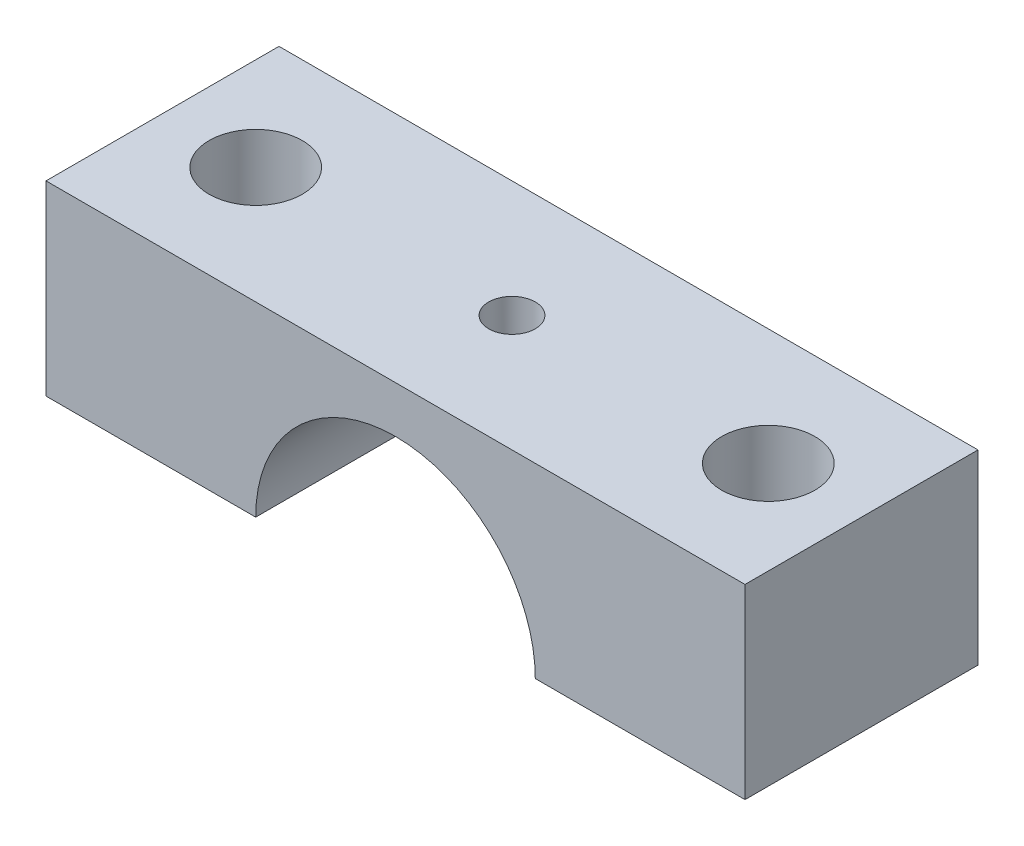
ISO-10303-21;
HEADER;
FILE_DESCRIPTION(('STEP AP214'),'2;1');
FILE_NAME('part.step','',(''),(''),'','','');
FILE_SCHEMA(('AUTOMOTIVE_DESIGN { 1 0 10303 214 1 1 1 1 }'));
ENDSEC;
DATA;
#1=APPLICATION_CONTEXT('core data for automotive mechanical design processes');
#2=APPLICATION_PROTOCOL_DEFINITION('international standard','automotive_design',2000,#1);
#3=PRODUCT_CONTEXT('',#1,'mechanical');
#4=PRODUCT('Part','Part','',(#3));
#5=PRODUCT_RELATED_PRODUCT_CATEGORY('part','',(#4));
#6=PRODUCT_DEFINITION_FORMATION('','',#4);
#7=PRODUCT_DEFINITION_CONTEXT('part definition',#1,'design');
#8=PRODUCT_DEFINITION('design','',#6,#7);
#9=PRODUCT_DEFINITION_SHAPE('','',#8);
#10=(LENGTH_UNIT() NAMED_UNIT(*) SI_UNIT(.MILLI.,.METRE.));
#11=(NAMED_UNIT(*) PLANE_ANGLE_UNIT() SI_UNIT($,.RADIAN.));
#12=(NAMED_UNIT(*) SI_UNIT($,.STERADIAN.) SOLID_ANGLE_UNIT());
#13=UNCERTAINTY_MEASURE_WITH_UNIT(LENGTH_MEASURE(1.E-05),#10,'distance_accuracy_value','');
#14=(GEOMETRIC_REPRESENTATION_CONTEXT(3) GLOBAL_UNCERTAINTY_ASSIGNED_CONTEXT((#13)) GLOBAL_UNIT_ASSIGNED_CONTEXT((#10,
#11,#12)) REPRESENTATION_CONTEXT('',''));
#15=CARTESIAN_POINT('',(0.,0.,0.));
#16=DIRECTION('',(0.,0.,1.));
#17=DIRECTION('',(1.,0.,0.));
#18=AXIS2_PLACEMENT_3D('',#15,#16,#17);
#19=CARTESIAN_POINT('',(0.,0.,0.));
#20=DIRECTION('',(0.,1.,0.));
#21=DIRECTION('',(0.,0.,1.));
#22=AXIS2_PLACEMENT_3D('',#19,#20,#21);
#23=PLANE('',#22);
#24=CARTESIAN_POINT('',(-11.,0.,0.));
#25=DIRECTION('',(0.,1.,0.));
#26=DIRECTION('',(0.,0.,1.));
#27=AXIS2_PLACEMENT_3D('',#24,#25,#26);
#28=CIRCLE('',#27,2.);
#29=CARTESIAN_POINT('',(-11.,0.,2.));
#30=VERTEX_POINT('',#29);
#31=EDGE_CURVE('E169',#30,#30,#28,.T.);
#32=ORIENTED_EDGE('',*,*,#31,.T.);
#33=EDGE_LOOP('',(#32));
#34=FACE_BOUND('',#33,.T.);
#35=DIRECTION('',(-1.,0.,0.));
#36=VECTOR('',#35,1.);
#37=CARTESIAN_POINT('',(-15.,0.,-5.));
#38=LINE('',#37,#36);
#39=CARTESIAN_POINT('',(-6.,0.,-5.));
#40=VERTEX_POINT('',#39);
#41=CARTESIAN_POINT('',(-15.,0.,-5.));
#42=VERTEX_POINT('',#41);
#43=EDGE_CURVE('E128',#40,#42,#38,.T.);
#44=ORIENTED_EDGE('',*,*,#43,.F.);
#45=DIRECTION('',(0.,0.,1.));
#46=VECTOR('',#45,1.);
#47=CARTESIAN_POINT('',(-6.,0.,-5.));
#48=LINE('',#47,#46);
#49=CARTESIAN_POINT('',(-6.,0.,5.));
#50=VERTEX_POINT('',#49);
#51=EDGE_CURVE('E110',#40,#50,#48,.T.);
#52=ORIENTED_EDGE('',*,*,#51,.T.);
#53=DIRECTION('',(1.,0.,0.));
#54=VECTOR('',#53,1.);
#55=CARTESIAN_POINT('',(-15.,0.,5.));
#56=LINE('',#55,#54);
#57=CARTESIAN_POINT('',(-15.,0.,5.));
#58=VERTEX_POINT('',#57);
#59=EDGE_CURVE('E137',#58,#50,#56,.T.);
#60=ORIENTED_EDGE('',*,*,#59,.F.);
#61=DIRECTION('',(0.,0.,1.));
#62=VECTOR('',#61,1.);
#63=CARTESIAN_POINT('',(-15.,0.,-5.));
#64=LINE('',#63,#62);
#65=EDGE_CURVE('E127',#42,#58,#64,.T.);
#66=ORIENTED_EDGE('',*,*,#65,.F.);
#67=EDGE_LOOP('',(#44,#52,#60,#66));
#68=FACE_BOUND('',#67,.T.);
#69=ADVANCED_FACE('F41',(#34,#68),#23,.F.);
#70=CARTESIAN_POINT('',(0.,8.,0.));
#71=DIRECTION('',(0.,1.,0.));
#72=DIRECTION('',(0.,0.,1.));
#73=AXIS2_PLACEMENT_3D('',#70,#71,#72);
#74=PLANE('',#73);
#75=CARTESIAN_POINT('',(11.,8.,0.));
#76=DIRECTION('',(0.,1.,0.));
#77=DIRECTION('',(0.,0.,1.));
#78=AXIS2_PLACEMENT_3D('',#75,#76,#77);
#79=CIRCLE('',#78,2.);
#80=CARTESIAN_POINT('',(11.,8.,1.99999999999999));
#81=VERTEX_POINT('',#80);
#82=EDGE_CURVE('E174',#81,#81,#79,.T.);
#83=ORIENTED_EDGE('',*,*,#82,.F.);
#84=EDGE_LOOP('',(#83));
#85=FACE_BOUND('',#84,.T.);
#86=DIRECTION('',(0.,0.,-1.));
#87=VECTOR('',#86,1.);
#88=CARTESIAN_POINT('',(15.,8.,-5.));
#89=LINE('',#88,#87);
#90=CARTESIAN_POINT('',(15.,8.,5.));
#91=VERTEX_POINT('',#90);
#92=CARTESIAN_POINT('',(15.,8.,-5.));
#93=VERTEX_POINT('',#92);
#94=EDGE_CURVE('E141',#91,#93,#89,.T.);
#95=ORIENTED_EDGE('',*,*,#94,.T.);
#96=DIRECTION('',(-1.,0.,0.));
#97=VECTOR('',#96,1.);
#98=CARTESIAN_POINT('',(-15.,8.,-5.));
#99=LINE('',#98,#97);
#100=CARTESIAN_POINT('',(-15.,8.,-5.));
#101=VERTEX_POINT('',#100);
#102=EDGE_CURVE('E99',#93,#101,#99,.T.);
#103=ORIENTED_EDGE('',*,*,#102,.T.);
#104=DIRECTION('',(0.,0.,1.));
#105=VECTOR('',#104,1.);
#106=CARTESIAN_POINT('',(-15.,8.,-5.));
#107=LINE('',#106,#105);
#108=CARTESIAN_POINT('',(-15.,8.,5.));
#109=VERTEX_POINT('',#108);
#110=EDGE_CURVE('E156',#101,#109,#107,.T.);
#111=ORIENTED_EDGE('',*,*,#110,.T.);
#112=DIRECTION('',(1.,0.,0.));
#113=VECTOR('',#112,1.);
#114=CARTESIAN_POINT('',(-15.,8.,5.));
#115=LINE('',#114,#113);
#116=EDGE_CURVE('E72',#109,#91,#115,.T.);
#117=ORIENTED_EDGE('',*,*,#116,.T.);
#118=EDGE_LOOP('',(#95,#103,#111,#117));
#119=FACE_BOUND('',#118,.T.);
#120=CARTESIAN_POINT('',(-11.,8.,0.));
#121=DIRECTION('',(0.,1.,0.));
#122=DIRECTION('',(0.,0.,1.));
#123=AXIS2_PLACEMENT_3D('',#120,#121,#122);
#124=CIRCLE('',#123,2.);
#125=CARTESIAN_POINT('',(-11.,8.,2.));
#126=VERTEX_POINT('',#125);
#127=EDGE_CURVE('E173',#126,#126,#124,.T.);
#128=ORIENTED_EDGE('',*,*,#127,.F.);
#129=EDGE_LOOP('',(#128));
#130=FACE_BOUND('',#129,.T.);
#131=CARTESIAN_POINT('',(0.,8.,0.));
#132=DIRECTION('',(0.,1.,0.));
#133=DIRECTION('',(0.,0.,1.));
#134=AXIS2_PLACEMENT_3D('',#131,#132,#133);
#135=CIRCLE('',#134,1.);
#136=CARTESIAN_POINT('',(0.,8.,0.999999999999997));
#137=VERTEX_POINT('',#136);
#138=EDGE_CURVE('E182',#137,#137,#135,.T.);
#139=ORIENTED_EDGE('',*,*,#138,.F.);
#140=EDGE_LOOP('',(#139));
#141=FACE_BOUND('',#140,.T.);
#142=ADVANCED_FACE('F196',(#85,#119,#130,#141),#74,.T.);
#143=CARTESIAN_POINT('',(6.,0.,5.));
#144=VERTEX_POINT('',#143);
#145=CARTESIAN_POINT('',(15.,0.,5.));
#146=VERTEX_POINT('',#145);
#147=EDGE_CURVE('E92',#144,#146,#56,.T.);
#148=ORIENTED_EDGE('',*,*,#147,.F.);
#149=DIRECTION('',(0.,0.,1.));
#150=VECTOR('',#149,1.);
#151=CARTESIAN_POINT('',(6.,0.,-5.));
#152=LINE('',#151,#150);
#153=CARTESIAN_POINT('',(6.,0.,-5.));
#154=VERTEX_POINT('',#153);
#155=EDGE_CURVE('E63',#144,#154,#152,.F.);
#156=ORIENTED_EDGE('',*,*,#155,.T.);
#157=CARTESIAN_POINT('',(15.,0.,-5.));
#158=VERTEX_POINT('',#157);
#159=EDGE_CURVE('E120',#158,#154,#38,.T.);
#160=ORIENTED_EDGE('',*,*,#159,.F.);
#161=DIRECTION('',(0.,0.,-1.));
#162=VECTOR('',#161,1.);
#163=CARTESIAN_POINT('',(15.,0.,-5.));
#164=LINE('',#163,#162);
#165=EDGE_CURVE('E133',#146,#158,#164,.T.);
#166=ORIENTED_EDGE('',*,*,#165,.F.);
#167=EDGE_LOOP('',(#148,#156,#160,#166));
#168=FACE_BOUND('',#167,.T.);
#169=CARTESIAN_POINT('',(11.,0.,0.));
#170=DIRECTION('',(0.,1.,0.));
#171=DIRECTION('',(0.,0.,1.));
#172=AXIS2_PLACEMENT_3D('',#169,#170,#171);
#173=CIRCLE('',#172,2.);
#174=CARTESIAN_POINT('',(11.,0.,1.99999999999999));
#175=VERTEX_POINT('',#174);
#176=EDGE_CURVE('E178',#175,#175,#173,.T.);
#177=ORIENTED_EDGE('',*,*,#176,.T.);
#178=EDGE_LOOP('',(#177));
#179=FACE_BOUND('',#178,.T.);
#180=ADVANCED_FACE('F117',(#168,#179),#23,.F.);
#181=CARTESIAN_POINT('',(15.,8.,-5.));
#182=DIRECTION('',(-1.,0.,0.));
#183=DIRECTION('',(0.,0.,1.));
#184=AXIS2_PLACEMENT_3D('',#181,#182,#183);
#185=PLANE('',#184);
#186=ORIENTED_EDGE('',*,*,#165,.T.);
#187=DIRECTION('',(0.,-1.,0.));
#188=VECTOR('',#187,1.);
#189=CARTESIAN_POINT('',(15.,8.,-5.));
#190=LINE('',#189,#188);
#191=EDGE_CURVE('E11',#93,#158,#190,.T.);
#192=ORIENTED_EDGE('',*,*,#191,.F.);
#193=ORIENTED_EDGE('',*,*,#94,.F.);
#194=DIRECTION('',(0.,-1.,0.));
#195=VECTOR('',#194,1.);
#196=CARTESIAN_POINT('',(15.,8.,5.));
#197=LINE('',#196,#195);
#198=EDGE_CURVE('E142',#91,#146,#197,.T.);
#199=ORIENTED_EDGE('',*,*,#198,.T.);
#200=EDGE_LOOP('',(#186,#192,#193,#199));
#201=FACE_BOUND('',#200,.T.);
#202=ADVANCED_FACE('F43',(#201),#185,.F.);
#203=CARTESIAN_POINT('',(-15.,8.,-5.));
#204=DIRECTION('',(0.,0.,1.));
#205=DIRECTION('',(1.,0.,0.));
#206=AXIS2_PLACEMENT_3D('',#203,#204,#205);
#207=PLANE('',#206);
#208=ORIENTED_EDGE('',*,*,#159,.T.);
#209=CARTESIAN_POINT('',(0.,0.,-5.));
#210=DIRECTION('',(0.,0.,1.));
#211=DIRECTION('',(1.,0.,0.));
#212=AXIS2_PLACEMENT_3D('',#209,#210,#211);
#213=CIRCLE('',#212,6.);
#214=EDGE_CURVE('E107',#154,#40,#213,.T.);
#215=ORIENTED_EDGE('',*,*,#214,.T.);
#216=ORIENTED_EDGE('',*,*,#43,.T.);
#217=DIRECTION('',(0.,-1.,0.));
#218=VECTOR('',#217,1.);
#219=CARTESIAN_POINT('',(-15.,8.,-5.));
#220=LINE('',#219,#218);
#221=EDGE_CURVE('E56',#101,#42,#220,.T.);
#222=ORIENTED_EDGE('',*,*,#221,.F.);
#223=ORIENTED_EDGE('',*,*,#102,.F.);
#224=ORIENTED_EDGE('',*,*,#191,.T.);
#225=EDGE_LOOP('',(#208,#215,#216,#222,#223,#224));
#226=FACE_BOUND('',#225,.T.);
#227=ADVANCED_FACE('F123',(#226),#207,.F.);
#228=CARTESIAN_POINT('',(-15.,8.,-5.));
#229=DIRECTION('',(1.,0.,0.));
#230=DIRECTION('',(0.,0.,-1.));
#231=AXIS2_PLACEMENT_3D('',#228,#229,#230);
#232=PLANE('',#231);
#233=ORIENTED_EDGE('',*,*,#65,.T.);
#234=DIRECTION('',(0.,-1.,0.));
#235=VECTOR('',#234,1.);
#236=CARTESIAN_POINT('',(-15.,8.,5.));
#237=LINE('',#236,#235);
#238=EDGE_CURVE('E145',#109,#58,#237,.T.);
#239=ORIENTED_EDGE('',*,*,#238,.F.);
#240=ORIENTED_EDGE('',*,*,#110,.F.);
#241=ORIENTED_EDGE('',*,*,#221,.T.);
#242=EDGE_LOOP('',(#233,#239,#240,#241));
#243=FACE_BOUND('',#242,.T.);
#244=ADVANCED_FACE('F154',(#243),#232,.F.);
#245=CARTESIAN_POINT('',(-15.,8.,5.));
#246=DIRECTION('',(0.,0.,-1.));
#247=DIRECTION('',(-1.,0.,0.));
#248=AXIS2_PLACEMENT_3D('',#245,#246,#247);
#249=PLANE('',#248);
#250=ORIENTED_EDGE('',*,*,#59,.T.);
#251=CARTESIAN_POINT('',(0.,0.,5.));
#252=DIRECTION('',(0.,0.,1.));
#253=DIRECTION('',(1.,0.,0.));
#254=AXIS2_PLACEMENT_3D('',#251,#252,#253);
#255=CIRCLE('',#254,6.);
#256=EDGE_CURVE('E114',#144,#50,#255,.T.);
#257=ORIENTED_EDGE('',*,*,#256,.F.);
#258=ORIENTED_EDGE('',*,*,#147,.T.);
#259=ORIENTED_EDGE('',*,*,#198,.F.);
#260=ORIENTED_EDGE('',*,*,#116,.F.);
#261=ORIENTED_EDGE('',*,*,#238,.T.);
#262=EDGE_LOOP('',(#250,#257,#258,#259,#260,#261));
#263=FACE_BOUND('',#262,.T.);
#264=ADVANCED_FACE('F159',(#263),#249,.F.);
#265=CARTESIAN_POINT('',(-11.,8.,0.));
#266=DIRECTION('',(0.,-1.,0.));
#267=DIRECTION('',(0.,0.,-1.));
#268=AXIS2_PLACEMENT_3D('',#265,#266,#267);
#269=CYLINDRICAL_SURFACE('',#268,2.);
#270=ORIENTED_EDGE('',*,*,#127,.T.);
#271=EDGE_LOOP('',(#270));
#272=FACE_BOUND('',#271,.T.);
#273=ORIENTED_EDGE('',*,*,#31,.F.);
#274=EDGE_LOOP('',(#273));
#275=FACE_BOUND('',#274,.T.);
#276=ADVANCED_FACE('F214',(#272,#275),#269,.F.);
#277=CARTESIAN_POINT('',(11.,8.,0.));
#278=DIRECTION('',(0.,-1.,0.));
#279=DIRECTION('',(0.,0.,-1.));
#280=AXIS2_PLACEMENT_3D('',#277,#278,#279);
#281=CYLINDRICAL_SURFACE('',#280,2.);
#282=ORIENTED_EDGE('',*,*,#82,.T.);
#283=EDGE_LOOP('',(#282));
#284=FACE_BOUND('',#283,.T.);
#285=ORIENTED_EDGE('',*,*,#176,.F.);
#286=EDGE_LOOP('',(#285));
#287=FACE_BOUND('',#286,.T.);
#288=ADVANCED_FACE('F207',(#284,#287),#281,.F.);
#289=CARTESIAN_POINT('',(0.,8.,0.));
#290=DIRECTION('',(0.,-1.,0.));
#291=DIRECTION('',(0.,0.,-1.));
#292=AXIS2_PLACEMENT_3D('',#289,#290,#291);
#293=CYLINDRICAL_SURFACE('',#292,1.);
#294=CARTESIAN_POINT('',(0.,6.,-1.));
#295=CARTESIAN_POINT('',(-0.0557563619832807,5.9999990446753,-0.999997764420877));
#296=CARTESIAN_POINT('',(-0.111543152735523,5.99921471165214,-0.995321090012435));
#297=CARTESIAN_POINT('',(-0.221552088669212,5.99616137976555,-0.976745736493873));
#298=CARTESIAN_POINT('',(-0.275772747183694,5.99389101569556,-0.962838577235362));
#299=CARTESIAN_POINT('',(-0.381041898885052,5.9881202729458,-0.926233820562901));
#300=CARTESIAN_POINT('',(-0.432092947372755,5.98462090063677,-0.903543413743774));
#301=CARTESIAN_POINT('',(-0.529656736791173,5.97677690832828,-0.850035083179045));
#302=CARTESIAN_POINT('',(-0.576169995951431,5.97243238501774,-0.819218089006804));
#303=CARTESIAN_POINT('',(-0.663789045716667,5.96333326983325,-0.75001796647182));
#304=CARTESIAN_POINT('',(-0.704845161413982,5.95857548725943,-0.711572354145552));
#305=CARTESIAN_POINT('',(-0.779955399463966,5.94921050750693,-0.628340812610879));
#306=CARTESIAN_POINT('',(-0.814009079756383,5.94460331985067,-0.583554483417359));
#307=CARTESIAN_POINT('',(-0.874346850242048,5.93603026303912,-0.488571613521181));
#308=CARTESIAN_POINT('',(-0.900581821144395,5.93206851636655,-0.438343465278101));
#309=CARTESIAN_POINT('',(-0.944223346164483,5.9252791591787,-0.334116174279753));
#310=CARTESIAN_POINT('',(-0.96163049662624,5.92245147205723,-0.280117286528951));
#311=CARTESIAN_POINT('',(-0.986965751113918,5.91828214737102,-0.170407890057388));
#312=CARTESIAN_POINT('',(-0.994979611654155,5.9169270739428,-0.114717705399446));
#313=CARTESIAN_POINT('',(-1.00156669011594,5.9158157557466,-0.00276788924661459));
#314=CARTESIAN_POINT('',(-1.00014057615559,5.91605939782886,0.0534917016669168));
#315=CARTESIAN_POINT('',(-0.987958039358455,5.91810571545422,0.164371144510177));
#316=CARTESIAN_POINT('',(-0.977297952755904,5.91989229327567,0.21900192141809));
#317=CARTESIAN_POINT('',(-0.947101256161373,5.92479798084403,0.325688527131651));
#318=CARTESIAN_POINT('',(-0.927564341727891,5.92791713629309,0.377744267555416));
#319=CARTESIAN_POINT('',(-0.88007089843756,5.9351539173364,0.478091529376365));
#320=CARTESIAN_POINT('',(-0.85207436555188,5.9392762684293,0.526363762432488));
#321=CARTESIAN_POINT('',(-0.788484807022968,5.94805167366004,0.617561760215351));
#322=CARTESIAN_POINT('',(-0.752891168261709,5.95270477061714,0.66048709298197));
#323=CARTESIAN_POINT('',(-0.674592884863615,5.96208811151914,0.740330434322936));
#324=CARTESIAN_POINT('',(-0.631805585549245,5.96681859692661,0.77716740741603));
#325=CARTESIAN_POINT('',(-0.540614099592652,5.97577040558689,0.843151105066134));
#326=CARTESIAN_POINT('',(-0.492209876762563,5.97999172555898,0.872297780073288));
#327=CARTESIAN_POINT('',(-0.391082366466678,5.98745557157165,0.92208089085451));
#328=CARTESIAN_POINT('',(-0.338355490225859,5.99069727362979,0.9427101677325));
#329=CARTESIAN_POINT('',(-0.230119338241087,5.99583001205064,0.974797686098388));
#330=CARTESIAN_POINT('',(-0.174610295671781,5.9977211614019,0.986256694789484));
#331=CARTESIAN_POINT('',(-0.0630839605206437,5.99992451937075,0.999568543384451));
#332=CARTESIAN_POINT('',(-0.00708029486039884,6.00025501205114,1.00153262872224));
#333=CARTESIAN_POINT('',(0.104455909155961,5.99934989768468,0.996095462228747));
#334=CARTESIAN_POINT('',(0.159988465556821,5.99811435089647,0.988694570746502));
#335=CARTESIAN_POINT('',(0.268662470218711,5.99422730775281,0.964830060265805));
#336=CARTESIAN_POINT('',(0.321816347354157,5.99158441920524,0.948421516643946));
#337=CARTESIAN_POINT('',(0.424618753944183,5.98517785782144,0.907066192720183));
#338=CARTESIAN_POINT('',(0.474267086363893,5.98141412204808,0.882118932945888));
#339=CARTESIAN_POINT('',(0.569132275787589,5.97313806520963,0.824139550121282));
#340=CARTESIAN_POINT('',(0.614306100374865,5.96861942354809,0.791037937533095));
#341=CARTESIAN_POINT('',(0.698497434201081,5.9593538695676,0.717785073845972));
#342=CARTESIAN_POINT('',(0.737514495878639,5.95460694068619,0.677633310689329));
#343=CARTESIAN_POINT('',(0.808697111863206,5.94536070094338,0.590920980771426));
#344=CARTESIAN_POINT('',(0.840787504445492,5.94086446454842,0.544298333794232));
#345=CARTESIAN_POINT('',(0.896680924118,5.93268611911154,0.44625881234458));
#346=CARTESIAN_POINT('',(0.920484213907934,5.92900398426408,0.394842089908998));
#347=CARTESIAN_POINT('',(0.959015332589265,5.92289381479082,0.288884106875143));
#348=CARTESIAN_POINT('',(0.973780573019183,5.92046061724426,0.234356761987801));
#349=CARTESIAN_POINT('',(0.993934181511316,5.91711086734104,0.123551948311291));
#350=CARTESIAN_POINT('',(0.999323364778473,5.91619418313089,0.0672746321071752));
#351=CARTESIAN_POINT('',(1.00054914641895,5.91598693233605,-0.0446820663849676));
#352=CARTESIAN_POINT('',(0.99650405445008,5.9166762260226,-0.100360151430119));
#353=CARTESIAN_POINT('',(0.979231935582745,5.91955912581491,-0.21023169922031));
#354=CARTESIAN_POINT('',(0.966004938444996,5.92175272704486,-0.264425166776752));
#355=CARTESIAN_POINT('',(0.930789795837965,5.92738942512687,-0.369743374917049));
#356=CARTESIAN_POINT('',(0.908811836240182,5.93083106887868,-0.420871604022414));
#357=CARTESIAN_POINT('',(0.856730801566368,5.93857747568883,-0.518734267677942));
#358=CARTESIAN_POINT('',(0.82662732349943,5.9428822815536,-0.565468484148858));
#359=CARTESIAN_POINT('',(0.758727553748867,5.95193381618249,-0.653814233243105));
#360=CARTESIAN_POINT('',(0.720844225437464,5.95668518230521,-0.695358406680113));
#361=CARTESIAN_POINT('',(0.638643612552097,5.96605748944336,-0.771540641789978));
#362=CARTESIAN_POINT('',(0.594324845165059,5.97067840010619,-0.806177107455272));
#363=CARTESIAN_POINT('',(0.500147667856117,5.97930611856888,-0.867779307279982));
#364=CARTESIAN_POINT('',(0.450253115013132,5.98330846501242,-0.894690415725184));
#365=CARTESIAN_POINT('',(0.346605227751597,5.9902046704071,-0.939707793843972));
#366=CARTESIAN_POINT('',(0.292855797932008,5.99309963270993,-0.957822832431882));
#367=CARTESIAN_POINT('',(0.199081324018165,5.99682316333182,-0.980802109650669));
#368=CARTESIAN_POINT('',(0.159623532119384,5.99800810909344,-0.987989787846389));
#369=CARTESIAN_POINT('',(0.0801157241279288,5.99959686394448,-0.997589495137904));
#370=CARTESIAN_POINT('',(0.0400657182434029,6.00000068648257,-1.00000160645495));
#371=CARTESIAN_POINT('',(0.,6.,-1.));
#372=B_SPLINE_CURVE_WITH_KNOTS('',3,(#294,#295,#296,#297,#298,#299,#300,#301,#302,#303,#304,
#305,#306,#307,#308,#309,#310,#311,#312,#313,#314,#315,#316,#317,#318,#319,#320,#321,#322,#323,
#324,#325,#326,#327,#328,#329,#330,#331,#332,#333,#334,#335,#336,#337,#338,#339,#340,#341,#342,
#343,#344,#345,#346,#347,#348,#349,#350,#351,#352,#353,#354,#355,#356,#357,#358,#359,#360,#361,
#362,#363,#364,#365,#366,#367,#368,#369,#370,#371),.UNSPECIFIED.,.T.,.F.,(4,2,2,2,2,2,2,2,2,2,2,
2,2,2,2,2,2,2,2,2,2,2,2,2,2,2,2,2,2,2,2,2,2,2,2,2,2,2,4),(0.,0.167122633975404,
0.334399018278168,0.501538746810108,0.668659365069916,0.837209964249328,1.00577120067943,
1.17537008329536,1.34495750750472,1.51298430841369,1.68099921728355,1.84728208704163,
2.01357066010152,2.18065822653023,2.34775928272229,2.51693107964531,2.68610396654339,
2.85541875566361,3.0247193780846,3.19203153396559,3.35933725214344,3.52563122802566,
3.69193454330427,3.8597073025081,4.02749225221713,4.19701528803048,4.36653294950377,
4.53534408936709,4.70414055114647,4.8708316380908,5.03752218475253,5.20401927290489,
5.37052462011734,5.53900553677357,5.70752533551589,5.8772089264288,6.04672300852029,
6.16681699265607,6.28690890910787),.UNSPECIFIED.);
#373=CARTESIAN_POINT('',(0.,6.,-1.));
#374=VERTEX_POINT('',#373);
#375=EDGE_CURVE('E45',#374,#374,#372,.T.);
#376=ORIENTED_EDGE('',*,*,#375,.F.);
#377=EDGE_LOOP('',(#376));
#378=FACE_BOUND('',#377,.T.);
#379=ORIENTED_EDGE('',*,*,#138,.T.);
#380=EDGE_LOOP('',(#379));
#381=FACE_BOUND('',#380,.T.);
#382=ADVANCED_FACE('F205',(#378,#381),#293,.F.);
#383=CARTESIAN_POINT('',(0.,0.,-5.));
#384=DIRECTION('',(0.,0.,1.));
#385=DIRECTION('',(1.,0.,0.));
#386=AXIS2_PLACEMENT_3D('',#383,#384,#385);
#387=CYLINDRICAL_SURFACE('',#386,6.);
#388=ORIENTED_EDGE('',*,*,#375,.T.);
#389=EDGE_LOOP('',(#388));
#390=FACE_BOUND('',#389,.T.);
#391=ORIENTED_EDGE('',*,*,#214,.F.);
#392=ORIENTED_EDGE('',*,*,#155,.F.);
#393=ORIENTED_EDGE('',*,*,#256,.T.);
#394=ORIENTED_EDGE('',*,*,#51,.F.);
#395=EDGE_LOOP('',(#391,#392,#393,#394));
#396=FACE_BOUND('',#395,.T.);
#397=ADVANCED_FACE('F108',(#390,#396),#387,.F.);
#398=CLOSED_SHELL('',(#69,#142,#180,#202,#227,#244,#264,#276,#288,#382,#397));
#399=MANIFOLD_SOLID_BREP('B2',#398);
#400=ADVANCED_BREP_SHAPE_REPRESENTATION('',(#18,#399),#14);
#401=SHAPE_DEFINITION_REPRESENTATION(#9,#400);
ENDSEC;
END-ISO-10303-21;
